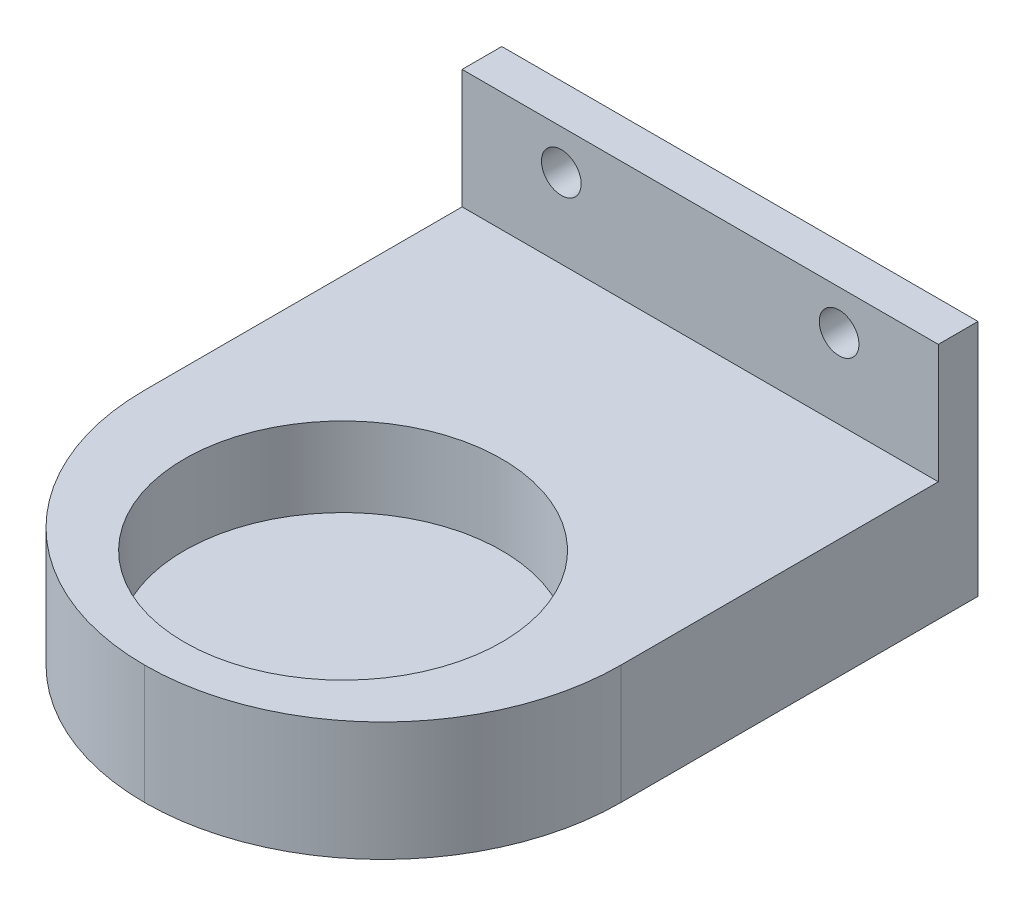
ISO-10303-21;
HEADER;
FILE_DESCRIPTION(('STEP AP214'),'2;1');
FILE_NAME('part.step','',(''),(''),'','','');
FILE_SCHEMA(('AUTOMOTIVE_DESIGN { 1 0 10303 214 1 1 1 1 }'));
ENDSEC;
DATA;
#1=APPLICATION_CONTEXT('core data for automotive mechanical design processes');
#2=APPLICATION_PROTOCOL_DEFINITION('international standard','automotive_design',2000,#1);
#3=PRODUCT_CONTEXT('',#1,'mechanical');
#4=PRODUCT('Part','Part','',(#3));
#5=PRODUCT_RELATED_PRODUCT_CATEGORY('part','',(#4));
#6=PRODUCT_DEFINITION_FORMATION('','',#4);
#7=PRODUCT_DEFINITION_CONTEXT('part definition',#1,'design');
#8=PRODUCT_DEFINITION('design','',#6,#7);
#9=PRODUCT_DEFINITION_SHAPE('','',#8);
#10=(LENGTH_UNIT() NAMED_UNIT(*) SI_UNIT(.MILLI.,.METRE.));
#11=(NAMED_UNIT(*) PLANE_ANGLE_UNIT() SI_UNIT($,.RADIAN.));
#12=(NAMED_UNIT(*) SI_UNIT($,.STERADIAN.) SOLID_ANGLE_UNIT());
#13=UNCERTAINTY_MEASURE_WITH_UNIT(LENGTH_MEASURE(1.E-05),#10,'distance_accuracy_value','');
#14=(GEOMETRIC_REPRESENTATION_CONTEXT(3) GLOBAL_UNCERTAINTY_ASSIGNED_CONTEXT((#13)) GLOBAL_UNIT_ASSIGNED_CONTEXT((#10,
#11,#12)) REPRESENTATION_CONTEXT('',''));
#15=CARTESIAN_POINT('',(0.,0.,0.));
#16=DIRECTION('',(0.,0.,1.));
#17=DIRECTION('',(1.,0.,0.));
#18=AXIS2_PLACEMENT_3D('',#15,#16,#17);
#19=CARTESIAN_POINT('',(30.,15.,5.));
#20=DIRECTION('',(-1.,0.,0.));
#21=DIRECTION('',(0.,-1.,0.));
#22=AXIS2_PLACEMENT_3D('',#19,#20,#21);
#23=PLANE('',#22);
#24=DIRECTION('',(0.,0.,-1.));
#25=VECTOR('',#24,1.);
#26=CARTESIAN_POINT('',(30.,0.,75.));
#27=LINE('',#26,#25);
#28=CARTESIAN_POINT('',(30.,0.,45.));
#29=VERTEX_POINT('',#28);
#30=CARTESIAN_POINT('',(30.,0.,5.));
#31=VERTEX_POINT('',#30);
#32=EDGE_CURVE('E109',#29,#31,#27,.T.);
#33=ORIENTED_EDGE('',*,*,#32,.F.);
#34=DIRECTION('',(0.,1.,0.));
#35=VECTOR('',#34,1.);
#36=CARTESIAN_POINT('',(30.,15.,45.));
#37=LINE('',#36,#35);
#38=CARTESIAN_POINT('',(30.,-15.,45.));
#39=VERTEX_POINT('',#38);
#40=EDGE_CURVE('E173',#29,#39,#37,.F.);
#41=ORIENTED_EDGE('',*,*,#40,.T.);
#42=DIRECTION('',(0.,0.,-1.));
#43=VECTOR('',#42,1.);
#44=CARTESIAN_POINT('',(30.,-15.,5.));
#45=LINE('',#44,#43);
#46=CARTESIAN_POINT('',(30.,-15.,0.));
#47=VERTEX_POINT('',#46);
#48=EDGE_CURVE('E120',#39,#47,#45,.T.);
#49=ORIENTED_EDGE('',*,*,#48,.T.);
#50=DIRECTION('',(0.,1.,0.));
#51=VECTOR('',#50,1.);
#52=CARTESIAN_POINT('',(30.,15.,0.));
#53=LINE('',#52,#51);
#54=CARTESIAN_POINT('',(30.,15.,0.));
#55=VERTEX_POINT('',#54);
#56=EDGE_CURVE('E135',#47,#55,#53,.T.);
#57=ORIENTED_EDGE('',*,*,#56,.T.);
#58=DIRECTION('',(0.,0.,-1.));
#59=VECTOR('',#58,1.);
#60=CARTESIAN_POINT('',(30.,15.,5.));
#61=LINE('',#60,#59);
#62=CARTESIAN_POINT('',(30.,15.,5.));
#63=VERTEX_POINT('',#62);
#64=EDGE_CURVE('E163',#63,#55,#61,.T.);
#65=ORIENTED_EDGE('',*,*,#64,.F.);
#66=DIRECTION('',(0.,1.,0.));
#67=VECTOR('',#66,1.);
#68=CARTESIAN_POINT('',(30.,15.,5.));
#69=LINE('',#68,#67);
#70=EDGE_CURVE('E136',#31,#63,#69,.T.);
#71=ORIENTED_EDGE('',*,*,#70,.F.);
#72=EDGE_LOOP('',(#33,#41,#49,#57,#65,#71));
#73=FACE_BOUND('',#72,.T.);
#74=ADVANCED_FACE('F42',(#73),#23,.F.);
#75=CARTESIAN_POINT('',(-30.,15.,5.));
#76=DIRECTION('',(0.,-1.,0.));
#77=DIRECTION('',(0.,0.,-1.));
#78=AXIS2_PLACEMENT_3D('',#75,#76,#77);
#79=PLANE('',#78);
#80=DIRECTION('',(-1.,0.,0.));
#81=VECTOR('',#80,1.);
#82=CARTESIAN_POINT('',(-30.,15.,0.));
#83=LINE('',#82,#81);
#84=CARTESIAN_POINT('',(-30.,15.,0.));
#85=VERTEX_POINT('',#84);
#86=EDGE_CURVE('E145',#55,#85,#83,.T.);
#87=ORIENTED_EDGE('',*,*,#86,.T.);
#88=DIRECTION('',(0.,0.,-1.));
#89=VECTOR('',#88,1.);
#90=CARTESIAN_POINT('',(-30.,15.,5.));
#91=LINE('',#90,#89);
#92=CARTESIAN_POINT('',(-30.,15.,5.));
#93=VERTEX_POINT('',#92);
#94=EDGE_CURVE('E160',#93,#85,#91,.T.);
#95=ORIENTED_EDGE('',*,*,#94,.F.);
#96=DIRECTION('',(-1.,0.,0.));
#97=VECTOR('',#96,1.);
#98=CARTESIAN_POINT('',(-30.,15.,5.));
#99=LINE('',#98,#97);
#100=EDGE_CURVE('E117',#63,#93,#99,.T.);
#101=ORIENTED_EDGE('',*,*,#100,.F.);
#102=ORIENTED_EDGE('',*,*,#64,.T.);
#103=EDGE_LOOP('',(#87,#95,#101,#102));
#104=FACE_BOUND('',#103,.T.);
#105=ADVANCED_FACE('F192',(#104),#79,.F.);
#106=CARTESIAN_POINT('',(-30.,15.,5.));
#107=DIRECTION('',(1.,0.,0.));
#108=DIRECTION('',(0.,1.,0.));
#109=AXIS2_PLACEMENT_3D('',#106,#107,#108);
#110=PLANE('',#109);
#111=DIRECTION('',(0.,0.,-1.));
#112=VECTOR('',#111,1.);
#113=CARTESIAN_POINT('',(-30.,-15.,5.));
#114=LINE('',#113,#112);
#115=CARTESIAN_POINT('',(-30.,-15.,45.));
#116=VERTEX_POINT('',#115);
#117=CARTESIAN_POINT('',(-30.,-15.,0.));
#118=VERTEX_POINT('',#117);
#119=EDGE_CURVE('E157',#116,#118,#114,.T.);
#120=ORIENTED_EDGE('',*,*,#119,.F.);
#121=DIRECTION('',(0.,-1.,0.));
#122=VECTOR('',#121,1.);
#123=CARTESIAN_POINT('',(-30.,15.,45.));
#124=LINE('',#123,#122);
#125=CARTESIAN_POINT('',(-30.,0.,45.));
#126=VERTEX_POINT('',#125);
#127=EDGE_CURVE('E11',#116,#126,#124,.F.);
#128=ORIENTED_EDGE('',*,*,#127,.T.);
#129=DIRECTION('',(0.,0.,-1.));
#130=VECTOR('',#129,1.);
#131=CARTESIAN_POINT('',(-30.,0.,75.));
#132=LINE('',#131,#130);
#133=CARTESIAN_POINT('',(-30.,0.,5.));
#134=VERTEX_POINT('',#133);
#135=EDGE_CURVE('E99',#126,#134,#132,.T.);
#136=ORIENTED_EDGE('',*,*,#135,.T.);
#137=DIRECTION('',(0.,-1.,0.));
#138=VECTOR('',#137,1.);
#139=CARTESIAN_POINT('',(-30.,15.,5.));
#140=LINE('',#139,#138);
#141=EDGE_CURVE('E103',#93,#134,#140,.T.);
#142=ORIENTED_EDGE('',*,*,#141,.F.);
#143=ORIENTED_EDGE('',*,*,#94,.T.);
#144=DIRECTION('',(0.,-1.,0.));
#145=VECTOR('',#144,1.);
#146=CARTESIAN_POINT('',(-30.,15.,0.));
#147=LINE('',#146,#145);
#148=EDGE_CURVE('E148',#85,#118,#147,.T.);
#149=ORIENTED_EDGE('',*,*,#148,.T.);
#150=EDGE_LOOP('',(#120,#128,#136,#142,#143,#149));
#151=FACE_BOUND('',#150,.T.);
#152=ADVANCED_FACE('F101',(#151),#110,.F.);
#153=CARTESIAN_POINT('',(-30.,-15.,5.));
#154=DIRECTION('',(0.,1.,0.));
#155=DIRECTION('',(0.,0.,1.));
#156=AXIS2_PLACEMENT_3D('',#153,#154,#155);
#157=PLANE('',#156);
#158=ORIENTED_EDGE('',*,*,#48,.F.);
#159=CARTESIAN_POINT('',(0.,-15.,45.));
#160=DIRECTION('',(0.,1.,0.));
#161=DIRECTION('',(0.,0.,1.));
#162=AXIS2_PLACEMENT_3D('',#159,#160,#161);
#163=CIRCLE('',#162,30.);
#164=CARTESIAN_POINT('',(0.,-15.,75.));
#165=VERTEX_POINT('',#164);
#166=EDGE_CURVE('E52',#39,#165,#163,.F.);
#167=ORIENTED_EDGE('',*,*,#166,.T.);
#168=CARTESIAN_POINT('',(0.,-15.,45.));
#169=DIRECTION('',(0.,1.,0.));
#170=DIRECTION('',(0.,0.,1.));
#171=AXIS2_PLACEMENT_3D('',#168,#169,#170);
#172=CIRCLE('',#171,30.);
#173=EDGE_CURVE('E59',#165,#116,#172,.F.);
#174=ORIENTED_EDGE('',*,*,#173,.T.);
#175=ORIENTED_EDGE('',*,*,#119,.T.);
#176=DIRECTION('',(1.,0.,0.));
#177=VECTOR('',#176,1.);
#178=CARTESIAN_POINT('',(-30.,-15.,0.));
#179=LINE('',#178,#177);
#180=EDGE_CURVE('E139',#118,#47,#179,.T.);
#181=ORIENTED_EDGE('',*,*,#180,.T.);
#182=EDGE_LOOP('',(#158,#167,#174,#175,#181));
#183=FACE_BOUND('',#182,.T.);
#184=ADVANCED_FACE('F184',(#183),#157,.F.);
#185=CARTESIAN_POINT('',(0.,0.,5.));
#186=DIRECTION('',(0.,0.,1.));
#187=DIRECTION('',(1.,0.,0.));
#188=AXIS2_PLACEMENT_3D('',#185,#186,#187);
#189=PLANE('',#188);
#190=CARTESIAN_POINT('',(-17.5,10.,5.));
#191=DIRECTION('',(0.,0.,-1.));
#192=DIRECTION('',(-1.,0.,0.));
#193=AXIS2_PLACEMENT_3D('',#190,#191,#192);
#194=CIRCLE('',#193,2.5);
#195=CARTESIAN_POINT('',(-20.,10.,5.));
#196=VERTEX_POINT('',#195);
#197=EDGE_CURVE('E223',#196,#196,#194,.T.);
#198=ORIENTED_EDGE('',*,*,#197,.T.);
#199=EDGE_LOOP('',(#198));
#200=FACE_BOUND('',#199,.T.);
#201=CARTESIAN_POINT('',(17.5,10.,5.));
#202=DIRECTION('',(0.,0.,-1.));
#203=DIRECTION('',(-1.,0.,0.));
#204=AXIS2_PLACEMENT_3D('',#201,#202,#203);
#205=CIRCLE('',#204,2.5);
#206=CARTESIAN_POINT('',(15.,10.,5.));
#207=VERTEX_POINT('',#206);
#208=EDGE_CURVE('E211',#207,#207,#205,.T.);
#209=ORIENTED_EDGE('',*,*,#208,.T.);
#210=EDGE_LOOP('',(#209));
#211=FACE_BOUND('',#210,.T.);
#212=DIRECTION('',(-1.,0.,0.));
#213=VECTOR('',#212,1.);
#214=CARTESIAN_POINT('',(-30.,0.,5.));
#215=LINE('',#214,#213);
#216=EDGE_CURVE('E110',#31,#134,#215,.T.);
#217=ORIENTED_EDGE('',*,*,#216,.F.);
#218=ORIENTED_EDGE('',*,*,#70,.T.);
#219=ORIENTED_EDGE('',*,*,#100,.T.);
#220=ORIENTED_EDGE('',*,*,#141,.T.);
#221=EDGE_LOOP('',(#217,#218,#219,#220));
#222=FACE_BOUND('',#221,.T.);
#223=ADVANCED_FACE('F114',(#200,#211,#222),#189,.T.);
#224=CARTESIAN_POINT('',(0.,0.,0.));
#225=DIRECTION('',(0.,0.,1.));
#226=DIRECTION('',(1.,0.,0.));
#227=AXIS2_PLACEMENT_3D('',#224,#225,#226);
#228=PLANE('',#227);
#229=CARTESIAN_POINT('',(17.5,-5.,0.));
#230=DIRECTION('',(0.,0.,-1.));
#231=DIRECTION('',(-1.,0.,0.));
#232=AXIS2_PLACEMENT_3D('',#229,#230,#231);
#233=CIRCLE('',#232,2.5);
#234=CARTESIAN_POINT('',(15.,-5.,0.));
#235=VERTEX_POINT('',#234);
#236=EDGE_CURVE('E201',#235,#235,#233,.T.);
#237=ORIENTED_EDGE('',*,*,#236,.F.);
#238=EDGE_LOOP('',(#237));
#239=FACE_BOUND('',#238,.T.);
#240=CARTESIAN_POINT('',(-17.5,-5.,0.));
#241=DIRECTION('',(0.,0.,-1.));
#242=DIRECTION('',(-1.,0.,0.));
#243=AXIS2_PLACEMENT_3D('',#240,#241,#242);
#244=CIRCLE('',#243,2.5);
#245=CARTESIAN_POINT('',(-20.,-5.,0.));
#246=VERTEX_POINT('',#245);
#247=EDGE_CURVE('E229',#246,#246,#244,.T.);
#248=ORIENTED_EDGE('',*,*,#247,.F.);
#249=EDGE_LOOP('',(#248));
#250=FACE_BOUND('',#249,.T.);
#251=CARTESIAN_POINT('',(-17.5,10.,0.));
#252=DIRECTION('',(0.,0.,-1.));
#253=DIRECTION('',(-1.,0.,0.));
#254=AXIS2_PLACEMENT_3D('',#251,#252,#253);
#255=CIRCLE('',#254,2.5);
#256=CARTESIAN_POINT('',(-20.,10.,0.));
#257=VERTEX_POINT('',#256);
#258=EDGE_CURVE('E218',#257,#257,#255,.T.);
#259=ORIENTED_EDGE('',*,*,#258,.F.);
#260=EDGE_LOOP('',(#259));
#261=FACE_BOUND('',#260,.T.);
#262=CARTESIAN_POINT('',(17.5,10.,0.));
#263=DIRECTION('',(0.,0.,-1.));
#264=DIRECTION('',(-1.,0.,0.));
#265=AXIS2_PLACEMENT_3D('',#262,#263,#264);
#266=CIRCLE('',#265,2.5);
#267=CARTESIAN_POINT('',(15.,10.,0.));
#268=VERTEX_POINT('',#267);
#269=EDGE_CURVE('E215',#268,#268,#266,.T.);
#270=ORIENTED_EDGE('',*,*,#269,.F.);
#271=EDGE_LOOP('',(#270));
#272=FACE_BOUND('',#271,.T.);
#273=ORIENTED_EDGE('',*,*,#56,.F.);
#274=ORIENTED_EDGE('',*,*,#180,.F.);
#275=ORIENTED_EDGE('',*,*,#148,.F.);
#276=ORIENTED_EDGE('',*,*,#86,.F.);
#277=EDGE_LOOP('',(#273,#274,#275,#276));
#278=FACE_BOUND('',#277,.T.);
#279=ADVANCED_FACE('F189',(#239,#250,#261,#272,#278),#228,.F.);
#280=CARTESIAN_POINT('',(-30.,0.,75.));
#281=DIRECTION('',(0.,-1.,0.));
#282=DIRECTION('',(0.,0.,-1.));
#283=AXIS2_PLACEMENT_3D('',#280,#281,#282);
#284=PLANE('',#283);
#285=CARTESIAN_POINT('',(0.,0.,50.));
#286=DIRECTION('',(0.,1.,0.));
#287=DIRECTION('',(0.,0.,1.));
#288=AXIS2_PLACEMENT_3D('',#285,#286,#287);
#289=CIRCLE('',#288,20.);
#290=CARTESIAN_POINT('',(0.,0.,70.));
#291=VERTEX_POINT('',#290);
#292=EDGE_CURVE('E129',#291,#291,#289,.T.);
#293=ORIENTED_EDGE('',*,*,#292,.F.);
#294=EDGE_LOOP('',(#293));
#295=FACE_BOUND('',#294,.T.);
#296=CARTESIAN_POINT('',(0.,0.,45.));
#297=DIRECTION('',(0.,-1.,0.));
#298=DIRECTION('',(0.,0.,-1.));
#299=AXIS2_PLACEMENT_3D('',#296,#297,#298);
#300=CIRCLE('',#299,30.);
#301=CARTESIAN_POINT('',(0.,0.,75.));
#302=VERTEX_POINT('',#301);
#303=EDGE_CURVE('E167',#126,#302,#300,.F.);
#304=ORIENTED_EDGE('',*,*,#303,.T.);
#305=CARTESIAN_POINT('',(0.,0.,45.));
#306=DIRECTION('',(0.,-1.,0.));
#307=DIRECTION('',(0.,0.,-1.));
#308=AXIS2_PLACEMENT_3D('',#305,#306,#307);
#309=CIRCLE('',#308,30.);
#310=EDGE_CURVE('E170',#302,#29,#309,.F.);
#311=ORIENTED_EDGE('',*,*,#310,.T.);
#312=ORIENTED_EDGE('',*,*,#32,.T.);
#313=ORIENTED_EDGE('',*,*,#216,.T.);
#314=ORIENTED_EDGE('',*,*,#135,.F.);
#315=EDGE_LOOP('',(#304,#311,#312,#313,#314));
#316=FACE_BOUND('',#315,.T.);
#317=ADVANCED_FACE('F122',(#295,#316),#284,.F.);
#318=CARTESIAN_POINT('',(0.,-10.,50.));
#319=DIRECTION('',(0.,1.,0.));
#320=DIRECTION('',(0.,0.,1.));
#321=AXIS2_PLACEMENT_3D('',#318,#319,#320);
#322=CYLINDRICAL_SURFACE('',#321,20.);
#323=CARTESIAN_POINT('',(0.,-10.,50.));
#324=DIRECTION('',(0.,1.,0.));
#325=DIRECTION('',(0.,0.,1.));
#326=AXIS2_PLACEMENT_3D('',#323,#324,#325);
#327=CIRCLE('',#326,20.);
#328=CARTESIAN_POINT('',(0.,-10.,70.));
#329=VERTEX_POINT('',#328);
#330=EDGE_CURVE('E125',#329,#329,#327,.T.);
#331=ORIENTED_EDGE('',*,*,#330,.F.);
#332=EDGE_LOOP('',(#331));
#333=FACE_BOUND('',#332,.T.);
#334=ORIENTED_EDGE('',*,*,#292,.T.);
#335=EDGE_LOOP('',(#334));
#336=FACE_BOUND('',#335,.T.);
#337=ADVANCED_FACE('F256',(#333,#336),#322,.F.);
#338=CARTESIAN_POINT('',(0.,-10.,50.));
#339=DIRECTION('',(0.,1.,0.));
#340=DIRECTION('',(0.,0.,1.));
#341=AXIS2_PLACEMENT_3D('',#338,#339,#340);
#342=PLANE('',#341);
#343=ORIENTED_EDGE('',*,*,#330,.T.);
#344=EDGE_LOOP('',(#343));
#345=FACE_BOUND('',#344,.T.);
#346=ADVANCED_FACE('F290',(#345),#342,.T.);
#347=CARTESIAN_POINT('',(17.5,10.,5.));
#348=DIRECTION('',(0.,0.,-1.));
#349=DIRECTION('',(-1.,0.,0.));
#350=AXIS2_PLACEMENT_3D('',#347,#348,#349);
#351=CYLINDRICAL_SURFACE('',#350,2.5);
#352=ORIENTED_EDGE('',*,*,#208,.F.);
#353=EDGE_LOOP('',(#352));
#354=FACE_BOUND('',#353,.T.);
#355=ORIENTED_EDGE('',*,*,#269,.T.);
#356=EDGE_LOOP('',(#355));
#357=FACE_BOUND('',#356,.T.);
#358=ADVANCED_FACE('F287',(#354,#357),#351,.F.);
#359=CARTESIAN_POINT('',(-17.5,10.,5.));
#360=DIRECTION('',(0.,0.,-1.));
#361=DIRECTION('',(-1.,0.,0.));
#362=AXIS2_PLACEMENT_3D('',#359,#360,#361);
#363=CYLINDRICAL_SURFACE('',#362,2.5);
#364=ORIENTED_EDGE('',*,*,#197,.F.);
#365=EDGE_LOOP('',(#364));
#366=FACE_BOUND('',#365,.T.);
#367=ORIENTED_EDGE('',*,*,#258,.T.);
#368=EDGE_LOOP('',(#367));
#369=FACE_BOUND('',#368,.T.);
#370=ADVANCED_FACE('F243',(#366,#369),#363,.F.);
#371=CARTESIAN_POINT('',(-17.5,-5.,5.));
#372=DIRECTION('',(0.,0.,-1.));
#373=DIRECTION('',(-1.,0.,0.));
#374=AXIS2_PLACEMENT_3D('',#371,#372,#373);
#375=CYLINDRICAL_SURFACE('',#374,2.5);
#376=CARTESIAN_POINT('',(-17.5,-5.,5.));
#377=DIRECTION('',(0.,0.,-1.));
#378=DIRECTION('',(-1.,0.,0.));
#379=AXIS2_PLACEMENT_3D('',#376,#377,#378);
#380=CIRCLE('',#379,2.5);
#381=CARTESIAN_POINT('',(-20.,-5.,5.));
#382=VERTEX_POINT('',#381);
#383=EDGE_CURVE('E207',#382,#382,#380,.T.);
#384=ORIENTED_EDGE('',*,*,#383,.F.);
#385=EDGE_LOOP('',(#384));
#386=FACE_BOUND('',#385,.T.);
#387=ORIENTED_EDGE('',*,*,#247,.T.);
#388=EDGE_LOOP('',(#387));
#389=FACE_BOUND('',#388,.T.);
#390=ADVANCED_FACE('F240',(#386,#389),#375,.F.);
#391=CARTESIAN_POINT('',(-17.5,-5.,5.));
#392=DIRECTION('',(0.,0.,-1.));
#393=DIRECTION('',(-1.,0.,0.));
#394=AXIS2_PLACEMENT_3D('',#391,#392,#393);
#395=PLANE('',#394);
#396=ORIENTED_EDGE('',*,*,#383,.T.);
#397=EDGE_LOOP('',(#396));
#398=FACE_BOUND('',#397,.T.);
#399=ADVANCED_FACE('F238',(#398),#395,.T.);
#400=CARTESIAN_POINT('',(17.5,-5.,5.));
#401=DIRECTION('',(0.,0.,-1.));
#402=DIRECTION('',(-1.,0.,0.));
#403=AXIS2_PLACEMENT_3D('',#400,#401,#402);
#404=CYLINDRICAL_SURFACE('',#403,2.5);
#405=CARTESIAN_POINT('',(17.5,-5.,5.));
#406=DIRECTION('',(0.,0.,-1.));
#407=DIRECTION('',(-1.,0.,0.));
#408=AXIS2_PLACEMENT_3D('',#405,#406,#407);
#409=CIRCLE('',#408,2.5);
#410=CARTESIAN_POINT('',(15.,-5.,5.));
#411=VERTEX_POINT('',#410);
#412=EDGE_CURVE('E198',#411,#411,#409,.T.);
#413=ORIENTED_EDGE('',*,*,#412,.F.);
#414=EDGE_LOOP('',(#413));
#415=FACE_BOUND('',#414,.T.);
#416=ORIENTED_EDGE('',*,*,#236,.T.);
#417=EDGE_LOOP('',(#416));
#418=FACE_BOUND('',#417,.T.);
#419=ADVANCED_FACE('F278',(#415,#418),#404,.F.);
#420=CARTESIAN_POINT('',(17.5,-5.,5.));
#421=DIRECTION('',(0.,0.,-1.));
#422=DIRECTION('',(-1.,0.,0.));
#423=AXIS2_PLACEMENT_3D('',#420,#421,#422);
#424=PLANE('',#423);
#425=ORIENTED_EDGE('',*,*,#412,.T.);
#426=EDGE_LOOP('',(#425));
#427=FACE_BOUND('',#426,.T.);
#428=ADVANCED_FACE('F274',(#427),#424,.T.);
#429=CARTESIAN_POINT('',(0.,0.,45.));
#430=DIRECTION('',(0.,-1.,0.));
#431=DIRECTION('',(1.,0.,0.));
#432=AXIS2_PLACEMENT_3D('',#429,#430,#431);
#433=CYLINDRICAL_SURFACE('',#432,30.);
#434=ORIENTED_EDGE('',*,*,#127,.F.);
#435=ORIENTED_EDGE('',*,*,#173,.F.);
#436=DIRECTION('',(0.,-1.,0.));
#437=VECTOR('',#436,1.);
#438=CARTESIAN_POINT('',(0.,0.,75.));
#439=LINE('',#438,#437);
#440=EDGE_CURVE('E46',#302,#165,#439,.T.);
#441=ORIENTED_EDGE('',*,*,#440,.F.);
#442=ORIENTED_EDGE('',*,*,#303,.F.);
#443=EDGE_LOOP('',(#434,#435,#441,#442));
#444=FACE_BOUND('',#443,.T.);
#445=ADVANCED_FACE('F44',(#444),#433,.T.);
#446=CARTESIAN_POINT('',(0.,0.,45.));
#447=DIRECTION('',(0.,1.,0.));
#448=DIRECTION('',(-1.,0.,0.));
#449=AXIS2_PLACEMENT_3D('',#446,#447,#448);
#450=CYLINDRICAL_SURFACE('',#449,30.);
#451=ORIENTED_EDGE('',*,*,#166,.F.);
#452=ORIENTED_EDGE('',*,*,#40,.F.);
#453=ORIENTED_EDGE('',*,*,#310,.F.);
#454=ORIENTED_EDGE('',*,*,#440,.T.);
#455=EDGE_LOOP('',(#451,#452,#453,#454));
#456=FACE_BOUND('',#455,.T.);
#457=ADVANCED_FACE('F196',(#456),#450,.T.);
#458=CLOSED_SHELL('',(#74,#105,#152,#184,#223,#279,#317,#337,#346,#358,#370,#390,#399,#419,#428,
#445,#457));
#459=MANIFOLD_SOLID_BREP('B2',#458);
#460=ADVANCED_BREP_SHAPE_REPRESENTATION('',(#18,#459),#14);
#461=SHAPE_DEFINITION_REPRESENTATION(#9,#460);
ENDSEC;
END-ISO-10303-21;
